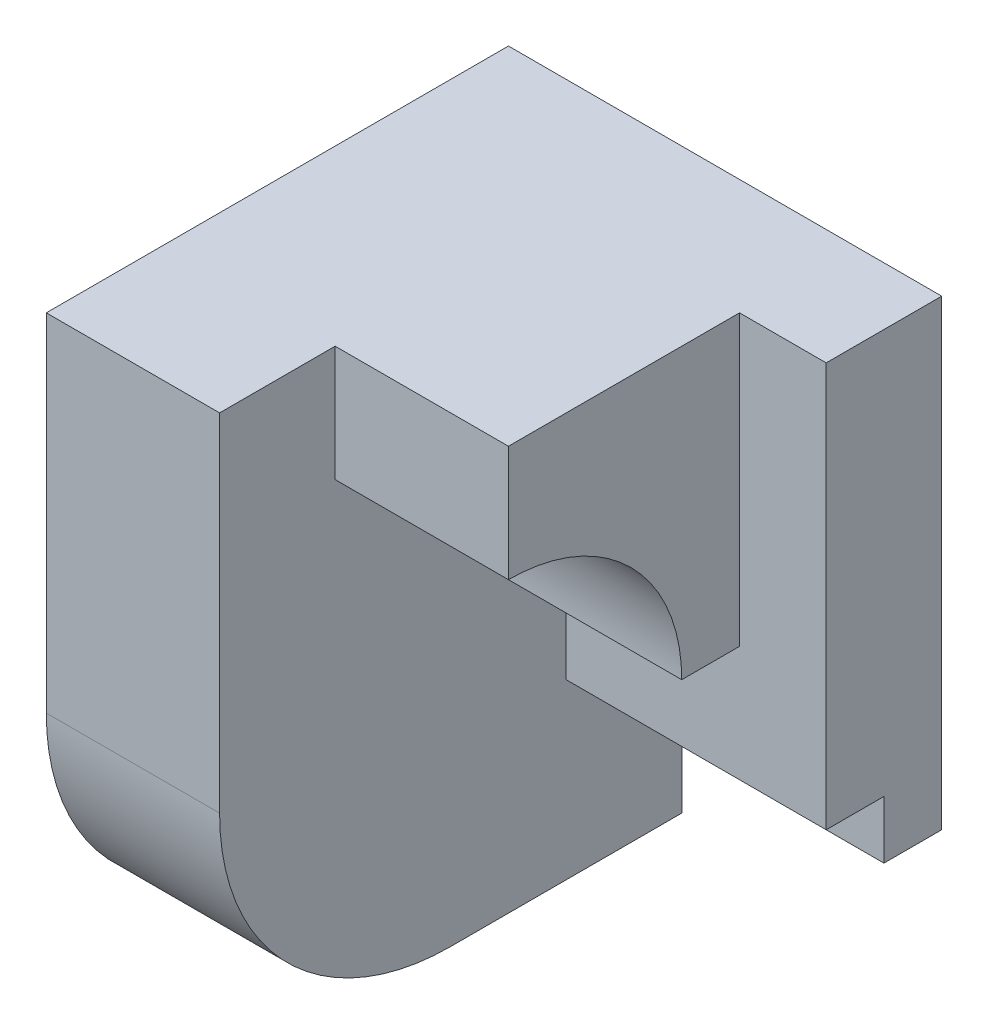
ISO-10303-21;
HEADER;
FILE_DESCRIPTION(('STEP AP214'),'2;1');
FILE_NAME('part.step','',(''),(''),'','','');
FILE_SCHEMA(('AUTOMOTIVE_DESIGN { 1 0 10303 214 1 1 1 1 }'));
ENDSEC;
DATA;
#1=APPLICATION_CONTEXT('core data for automotive mechanical design processes');
#2=APPLICATION_PROTOCOL_DEFINITION('international standard','automotive_design',2000,#1);
#3=PRODUCT_CONTEXT('',#1,'mechanical');
#4=PRODUCT('Part','Part','',(#3));
#5=PRODUCT_RELATED_PRODUCT_CATEGORY('part','',(#4));
#6=PRODUCT_DEFINITION_FORMATION('','',#4);
#7=PRODUCT_DEFINITION_CONTEXT('part definition',#1,'design');
#8=PRODUCT_DEFINITION('design','',#6,#7);
#9=PRODUCT_DEFINITION_SHAPE('','',#8);
#10=(LENGTH_UNIT() NAMED_UNIT(*) SI_UNIT(.MILLI.,.METRE.));
#11=(NAMED_UNIT(*) PLANE_ANGLE_UNIT() SI_UNIT($,.RADIAN.));
#12=(NAMED_UNIT(*) SI_UNIT($,.STERADIAN.) SOLID_ANGLE_UNIT());
#13=UNCERTAINTY_MEASURE_WITH_UNIT(LENGTH_MEASURE(1.E-05),#10,'distance_accuracy_value','');
#14=(GEOMETRIC_REPRESENTATION_CONTEXT(3) GLOBAL_UNCERTAINTY_ASSIGNED_CONTEXT((#13)) GLOBAL_UNIT_ASSIGNED_CONTEXT((#10,
#11,#12)) REPRESENTATION_CONTEXT('',''));
#15=CARTESIAN_POINT('',(0.,0.,0.));
#16=DIRECTION('',(0.,0.,1.));
#17=DIRECTION('',(1.,0.,0.));
#18=AXIS2_PLACEMENT_3D('',#15,#16,#17);
#19=CARTESIAN_POINT('',(3.,-1.,0.));
#20=DIRECTION('',(-1.,0.,0.));
#21=DIRECTION('',(0.,0.,1.));
#22=AXIS2_PLACEMENT_3D('',#19,#20,#21);
#23=PLANE('',#22);
#24=DIRECTION('',(0.,-1.,0.));
#25=VECTOR('',#24,1.);
#26=CARTESIAN_POINT('',(3.,0.,-2.));
#27=LINE('',#26,#25);
#28=CARTESIAN_POINT('',(3.,0.,-2.));
#29=VERTEX_POINT('',#28);
#30=CARTESIAN_POINT('',(3.,-2.,-2.));
#31=VERTEX_POINT('',#30);
#32=EDGE_CURVE('E193',#29,#31,#27,.T.);
#33=ORIENTED_EDGE('',*,*,#32,.F.);
#34=DIRECTION('',(0.,0.,1.));
#35=VECTOR('',#34,1.);
#36=CARTESIAN_POINT('',(3.,0.,0.));
#37=LINE('',#36,#35);
#38=CARTESIAN_POINT('',(3.,0.,-1.));
#39=VERTEX_POINT('',#38);
#40=EDGE_CURVE('E164',#29,#39,#37,.T.);
#41=ORIENTED_EDGE('',*,*,#40,.T.);
#42=CARTESIAN_POINT('',(3.,0.,2.));
#43=DIRECTION('',(1.,0.,0.));
#44=DIRECTION('',(0.,0.,-1.));
#45=AXIS2_PLACEMENT_3D('',#42,#43,#44);
#46=CIRCLE('',#45,3.);
#47=CARTESIAN_POINT('',(3.,3.,2.));
#48=VERTEX_POINT('',#47);
#49=EDGE_CURVE('E141',#39,#48,#46,.T.);
#50=ORIENTED_EDGE('',*,*,#49,.T.);
#51=DIRECTION('',(0.,-1.,0.));
#52=VECTOR('',#51,1.);
#53=CARTESIAN_POINT('',(3.,0.,2.));
#54=LINE('',#53,#52);
#55=CARTESIAN_POINT('',(3.,5.,2.));
#56=VERTEX_POINT('',#55);
#57=EDGE_CURVE('E150',#56,#48,#54,.T.);
#58=ORIENTED_EDGE('',*,*,#57,.F.);
#59=DIRECTION('',(0.,0.,1.));
#60=VECTOR('',#59,1.);
#61=CARTESIAN_POINT('',(3.,5.,-4.));
#62=LINE('',#61,#60);
#63=CARTESIAN_POINT('',(3.,5.,4.));
#64=VERTEX_POINT('',#63);
#65=EDGE_CURVE('E220',#56,#64,#62,.T.);
#66=ORIENTED_EDGE('',*,*,#65,.T.);
#67=DIRECTION('',(0.,-1.,0.));
#68=VECTOR('',#67,1.);
#69=CARTESIAN_POINT('',(3.,-0.999999999999971,4.));
#70=LINE('',#69,#68);
#71=CARTESIAN_POINT('',(3.,-1.,4.));
#72=VERTEX_POINT('',#71);
#73=EDGE_CURVE('E209',#64,#72,#70,.T.);
#74=ORIENTED_EDGE('',*,*,#73,.T.);
#75=CARTESIAN_POINT('',(3.,-1.,0.));
#76=DIRECTION('',(1.,0.,0.));
#77=DIRECTION('',(0.,0.,1.));
#78=AXIS2_PLACEMENT_3D('',#75,#76,#77);
#79=CIRCLE('',#78,4.);
#80=CARTESIAN_POINT('',(3.,-5.,0.));
#81=VERTEX_POINT('',#80);
#82=EDGE_CURVE('E212',#72,#81,#79,.T.);
#83=ORIENTED_EDGE('',*,*,#82,.T.);
#84=DIRECTION('',(0.,0.,-1.));
#85=VECTOR('',#84,1.);
#86=CARTESIAN_POINT('',(3.,-5.,-4.));
#87=LINE('',#86,#85);
#88=CARTESIAN_POINT('',(3.,-5.,-4.));
#89=VERTEX_POINT('',#88);
#90=EDGE_CURVE('E215',#81,#89,#87,.T.);
#91=ORIENTED_EDGE('',*,*,#90,.T.);
#92=DIRECTION('',(0.,1.,0.));
#93=VECTOR('',#92,1.);
#94=CARTESIAN_POINT('',(3.,-5.,-4.));
#95=LINE('',#94,#93);
#96=CARTESIAN_POINT('',(3.,-3.,-4.));
#97=VERTEX_POINT('',#96);
#98=EDGE_CURVE('E217',#89,#97,#95,.T.);
#99=ORIENTED_EDGE('',*,*,#98,.T.);
#100=DIRECTION('',(0.,0.,1.));
#101=VECTOR('',#100,1.);
#102=CARTESIAN_POINT('',(3.,-3.,0.));
#103=LINE('',#102,#101);
#104=CARTESIAN_POINT('',(3.,-3.,-3.));
#105=VERTEX_POINT('',#104);
#106=EDGE_CURVE('E190',#97,#105,#103,.T.);
#107=ORIENTED_EDGE('',*,*,#106,.T.);
#108=DIRECTION('',(0.,1.,0.));
#109=VECTOR('',#108,1.);
#110=CARTESIAN_POINT('',(3.,0.,-3.));
#111=LINE('',#110,#109);
#112=CARTESIAN_POINT('',(3.,-2.,-3.));
#113=VERTEX_POINT('',#112);
#114=EDGE_CURVE('E58',#105,#113,#111,.T.);
#115=ORIENTED_EDGE('',*,*,#114,.T.);
#116=DIRECTION('',(0.,0.,-1.));
#117=VECTOR('',#116,1.);
#118=CARTESIAN_POINT('',(3.,-2.,0.));
#119=LINE('',#118,#117);
#120=EDGE_CURVE('E176',#31,#113,#119,.T.);
#121=ORIENTED_EDGE('',*,*,#120,.F.);
#122=EDGE_LOOP('',(#33,#41,#50,#58,#66,#74,#83,#91,#99,#107,#115,#121));
#123=FACE_BOUND('',#122,.T.);
#124=ADVANCED_FACE('F35',(#123),#23,.F.);
#125=CARTESIAN_POINT('',(3.,-0.999999999999971,4.));
#126=DIRECTION('',(0.,0.,-1.));
#127=DIRECTION('',(-1.,0.,0.));
#128=AXIS2_PLACEMENT_3D('',#125,#126,#127);
#129=PLANE('',#128);
#130=DIRECTION('',(0.,-1.,0.));
#131=VECTOR('',#130,1.);
#132=CARTESIAN_POINT('',(0.,-0.999999999999971,4.));
#133=LINE('',#132,#131);
#134=CARTESIAN_POINT('',(0.,5.,4.));
#135=VERTEX_POINT('',#134);
#136=CARTESIAN_POINT('',(0.,-1.,4.));
#137=VERTEX_POINT('',#136);
#138=EDGE_CURVE('E208',#135,#137,#133,.T.);
#139=ORIENTED_EDGE('',*,*,#138,.T.);
#140=DIRECTION('',(-1.,0.,0.));
#141=VECTOR('',#140,1.);
#142=CARTESIAN_POINT('',(3.,-1.,4.));
#143=LINE('',#142,#141);
#144=EDGE_CURVE('E11',#72,#137,#143,.T.);
#145=ORIENTED_EDGE('',*,*,#144,.F.);
#146=ORIENTED_EDGE('',*,*,#73,.F.);
#147=DIRECTION('',(-1.,0.,0.));
#148=VECTOR('',#147,1.);
#149=CARTESIAN_POINT('',(3.,5.,4.));
#150=LINE('',#149,#148);
#151=EDGE_CURVE('E222',#64,#135,#150,.T.);
#152=ORIENTED_EDGE('',*,*,#151,.T.);
#153=EDGE_LOOP('',(#139,#145,#146,#152));
#154=FACE_BOUND('',#153,.T.);
#155=ADVANCED_FACE('F37',(#154),#129,.F.);
#156=CARTESIAN_POINT('',(3.,-1.,0.));
#157=DIRECTION('',(-1.,0.,0.));
#158=DIRECTION('',(0.,0.,1.));
#159=AXIS2_PLACEMENT_3D('',#156,#157,#158);
#160=CYLINDRICAL_SURFACE('',#159,4.);
#161=CARTESIAN_POINT('',(0.,-1.,0.));
#162=DIRECTION('',(1.,0.,0.));
#163=DIRECTION('',(0.,0.,1.));
#164=AXIS2_PLACEMENT_3D('',#161,#162,#163);
#165=CIRCLE('',#164,4.);
#166=CARTESIAN_POINT('',(0.,-5.,0.));
#167=VERTEX_POINT('',#166);
#168=EDGE_CURVE('E225',#137,#167,#165,.T.);
#169=ORIENTED_EDGE('',*,*,#168,.T.);
#170=DIRECTION('',(-1.,0.,0.));
#171=VECTOR('',#170,1.);
#172=CARTESIAN_POINT('',(3.,-5.,0.));
#173=LINE('',#172,#171);
#174=EDGE_CURVE('E43',#81,#167,#173,.T.);
#175=ORIENTED_EDGE('',*,*,#174,.F.);
#176=ORIENTED_EDGE('',*,*,#82,.F.);
#177=ORIENTED_EDGE('',*,*,#144,.T.);
#178=EDGE_LOOP('',(#169,#175,#176,#177));
#179=FACE_BOUND('',#178,.T.);
#180=ADVANCED_FACE('F276',(#179),#160,.T.);
#181=CARTESIAN_POINT('',(3.,-5.,-4.));
#182=DIRECTION('',(0.,1.,0.));
#183=DIRECTION('',(0.,0.,1.));
#184=AXIS2_PLACEMENT_3D('',#181,#182,#183);
#185=PLANE('',#184);
#186=DIRECTION('',(0.,0.,-1.));
#187=VECTOR('',#186,1.);
#188=CARTESIAN_POINT('',(0.,-5.,-4.));
#189=LINE('',#188,#187);
#190=CARTESIAN_POINT('',(0.,-5.,-4.));
#191=VERTEX_POINT('',#190);
#192=EDGE_CURVE('E227',#167,#191,#189,.T.);
#193=ORIENTED_EDGE('',*,*,#192,.T.);
#194=DIRECTION('',(-1.,0.,0.));
#195=VECTOR('',#194,1.);
#196=CARTESIAN_POINT('',(3.,-5.,-4.));
#197=LINE('',#196,#195);
#198=EDGE_CURVE('E237',#89,#191,#197,.T.);
#199=ORIENTED_EDGE('',*,*,#198,.F.);
#200=ORIENTED_EDGE('',*,*,#90,.F.);
#201=ORIENTED_EDGE('',*,*,#174,.T.);
#202=EDGE_LOOP('',(#193,#199,#200,#201));
#203=FACE_BOUND('',#202,.T.);
#204=ADVANCED_FACE('F244',(#203),#185,.F.);
#205=CARTESIAN_POINT('',(3.,-5.,-4.));
#206=DIRECTION('',(0.,0.,1.));
#207=DIRECTION('',(1.,0.,0.));
#208=AXIS2_PLACEMENT_3D('',#205,#206,#207);
#209=PLANE('',#208);
#210=DIRECTION('',(0.,1.,0.));
#211=VECTOR('',#210,1.);
#212=CARTESIAN_POINT('',(0.,-5.,-4.));
#213=LINE('',#212,#211);
#214=CARTESIAN_POINT('',(0.,5.,-4.));
#215=VERTEX_POINT('',#214);
#216=EDGE_CURVE('E229',#191,#215,#213,.T.);
#217=ORIENTED_EDGE('',*,*,#216,.T.);
#218=DIRECTION('',(-1.,0.,0.));
#219=VECTOR('',#218,1.);
#220=CARTESIAN_POINT('',(3.,5.,-4.));
#221=LINE('',#220,#219);
#222=CARTESIAN_POINT('',(7.5,5.,-4.));
#223=VERTEX_POINT('',#222);
#224=EDGE_CURVE('E234',#223,#215,#221,.T.);
#225=ORIENTED_EDGE('',*,*,#224,.F.);
#226=DIRECTION('',(0.,1.,0.));
#227=VECTOR('',#226,1.);
#228=CARTESIAN_POINT('',(7.5,0.,-4.));
#229=LINE('',#228,#227);
#230=CARTESIAN_POINT('',(7.5,-3.,-4.));
#231=VERTEX_POINT('',#230);
#232=EDGE_CURVE('E179',#231,#223,#229,.T.);
#233=ORIENTED_EDGE('',*,*,#232,.F.);
#234=DIRECTION('',(-1.,0.,0.));
#235=VECTOR('',#234,1.);
#236=CARTESIAN_POINT('',(7.5,-3.,-4.));
#237=LINE('',#236,#235);
#238=EDGE_CURVE('E204',#231,#97,#237,.T.);
#239=ORIENTED_EDGE('',*,*,#238,.T.);
#240=ORIENTED_EDGE('',*,*,#98,.F.);
#241=ORIENTED_EDGE('',*,*,#198,.T.);
#242=EDGE_LOOP('',(#217,#225,#233,#239,#240,#241));
#243=FACE_BOUND('',#242,.T.);
#244=ADVANCED_FACE('F253',(#243),#209,.F.);
#245=CARTESIAN_POINT('',(3.,5.,-4.));
#246=DIRECTION('',(0.,-1.,0.));
#247=DIRECTION('',(0.,0.,-1.));
#248=AXIS2_PLACEMENT_3D('',#245,#246,#247);
#249=PLANE('',#248);
#250=ORIENTED_EDGE('',*,*,#65,.F.);
#251=DIRECTION('',(-1.,0.,0.));
#252=VECTOR('',#251,1.);
#253=CARTESIAN_POINT('',(6.,5.,2.));
#254=LINE('',#253,#252);
#255=CARTESIAN_POINT('',(6.,5.,2.));
#256=VERTEX_POINT('',#255);
#257=EDGE_CURVE('E169',#256,#56,#254,.T.);
#258=ORIENTED_EDGE('',*,*,#257,.F.);
#259=DIRECTION('',(0.,0.,1.));
#260=VECTOR('',#259,1.);
#261=CARTESIAN_POINT('',(6.,5.,0.));
#262=LINE('',#261,#260);
#263=CARTESIAN_POINT('',(6.,5.,-2.));
#264=VERTEX_POINT('',#263);
#265=EDGE_CURVE('E157',#264,#256,#262,.T.);
#266=ORIENTED_EDGE('',*,*,#265,.F.);
#267=DIRECTION('',(-1.,0.,0.));
#268=VECTOR('',#267,1.);
#269=CARTESIAN_POINT('',(7.5,5.,-2.));
#270=LINE('',#269,#268);
#271=CARTESIAN_POINT('',(7.5,5.,-2.));
#272=VERTEX_POINT('',#271);
#273=EDGE_CURVE('E201',#272,#264,#270,.T.);
#274=ORIENTED_EDGE('',*,*,#273,.F.);
#275=DIRECTION('',(0.,0.,1.));
#276=VECTOR('',#275,1.);
#277=CARTESIAN_POINT('',(7.5,5.,0.));
#278=LINE('',#277,#276);
#279=EDGE_CURVE('E182',#223,#272,#278,.T.);
#280=ORIENTED_EDGE('',*,*,#279,.F.);
#281=ORIENTED_EDGE('',*,*,#224,.T.);
#282=DIRECTION('',(0.,0.,1.));
#283=VECTOR('',#282,1.);
#284=CARTESIAN_POINT('',(0.,5.,-4.));
#285=LINE('',#284,#283);
#286=EDGE_CURVE('E213',#215,#135,#285,.T.);
#287=ORIENTED_EDGE('',*,*,#286,.T.);
#288=ORIENTED_EDGE('',*,*,#151,.F.);
#289=EDGE_LOOP('',(#250,#258,#266,#274,#280,#281,#287,#288));
#290=FACE_BOUND('',#289,.T.);
#291=ADVANCED_FACE('F259',(#290),#249,.F.);
#292=CARTESIAN_POINT('',(0.,-1.,0.));
#293=DIRECTION('',(-1.,0.,0.));
#294=DIRECTION('',(0.,0.,1.));
#295=AXIS2_PLACEMENT_3D('',#292,#293,#294);
#296=PLANE('',#295);
#297=ORIENTED_EDGE('',*,*,#138,.F.);
#298=ORIENTED_EDGE('',*,*,#286,.F.);
#299=ORIENTED_EDGE('',*,*,#216,.F.);
#300=ORIENTED_EDGE('',*,*,#192,.F.);
#301=ORIENTED_EDGE('',*,*,#168,.F.);
#302=EDGE_LOOP('',(#297,#298,#299,#300,#301));
#303=FACE_BOUND('',#302,.T.);
#304=ADVANCED_FACE('F250',(#303),#296,.T.);
#305=CARTESIAN_POINT('',(7.5,0.,-3.));
#306=DIRECTION('',(0.,0.,1.));
#307=DIRECTION('',(1.,0.,0.));
#308=AXIS2_PLACEMENT_3D('',#305,#306,#307);
#309=PLANE('',#308);
#310=ORIENTED_EDGE('',*,*,#114,.F.);
#311=DIRECTION('',(-1.,0.,0.));
#312=VECTOR('',#311,1.);
#313=CARTESIAN_POINT('',(7.5,-3.,-3.));
#314=LINE('',#313,#312);
#315=CARTESIAN_POINT('',(7.5,-3.,-3.));
#316=VERTEX_POINT('',#315);
#317=EDGE_CURVE('E206',#316,#105,#314,.T.);
#318=ORIENTED_EDGE('',*,*,#317,.F.);
#319=DIRECTION('',(0.,1.,0.));
#320=VECTOR('',#319,1.);
#321=CARTESIAN_POINT('',(7.5,0.,-3.));
#322=LINE('',#321,#320);
#323=CARTESIAN_POINT('',(7.5,-2.,-3.));
#324=VERTEX_POINT('',#323);
#325=EDGE_CURVE('E172',#316,#324,#322,.T.);
#326=ORIENTED_EDGE('',*,*,#325,.T.);
#327=DIRECTION('',(-1.,0.,0.));
#328=VECTOR('',#327,1.);
#329=CARTESIAN_POINT('',(7.5,-2.,-3.));
#330=LINE('',#329,#328);
#331=EDGE_CURVE('E188',#324,#113,#330,.T.);
#332=ORIENTED_EDGE('',*,*,#331,.T.);
#333=EDGE_LOOP('',(#310,#318,#326,#332));
#334=FACE_BOUND('',#333,.T.);
#335=ADVANCED_FACE('F297',(#334),#309,.T.);
#336=CARTESIAN_POINT('',(7.5,-3.,0.));
#337=DIRECTION('',(0.,-1.,0.));
#338=DIRECTION('',(0.,0.,-1.));
#339=AXIS2_PLACEMENT_3D('',#336,#337,#338);
#340=PLANE('',#339);
#341=ORIENTED_EDGE('',*,*,#106,.F.);
#342=ORIENTED_EDGE('',*,*,#238,.F.);
#343=DIRECTION('',(0.,0.,1.));
#344=VECTOR('',#343,1.);
#345=CARTESIAN_POINT('',(7.5,-3.,0.));
#346=LINE('',#345,#344);
#347=EDGE_CURVE('E175',#231,#316,#346,.T.);
#348=ORIENTED_EDGE('',*,*,#347,.T.);
#349=ORIENTED_EDGE('',*,*,#317,.T.);
#350=EDGE_LOOP('',(#341,#342,#348,#349));
#351=FACE_BOUND('',#350,.T.);
#352=ADVANCED_FACE('F271',(#351),#340,.T.);
#353=CARTESIAN_POINT('',(7.5,0.,-2.));
#354=DIRECTION('',(0.,0.,-1.));
#355=DIRECTION('',(-1.,0.,0.));
#356=AXIS2_PLACEMENT_3D('',#353,#354,#355);
#357=PLANE('',#356);
#358=DIRECTION('',(0.,1.,0.));
#359=VECTOR('',#358,1.);
#360=CARTESIAN_POINT('',(6.,0.,-2.));
#361=LINE('',#360,#359);
#362=CARTESIAN_POINT('',(6.,0.,-2.));
#363=VERTEX_POINT('',#362);
#364=EDGE_CURVE('E155',#363,#264,#361,.T.);
#365=ORIENTED_EDGE('',*,*,#364,.F.);
#366=DIRECTION('',(-1.,0.,0.));
#367=VECTOR('',#366,1.);
#368=CARTESIAN_POINT('',(6.,0.,-2.));
#369=LINE('',#368,#367);
#370=EDGE_CURVE('E144',#363,#29,#369,.T.);
#371=ORIENTED_EDGE('',*,*,#370,.T.);
#372=ORIENTED_EDGE('',*,*,#32,.T.);
#373=DIRECTION('',(-1.,0.,0.));
#374=VECTOR('',#373,1.);
#375=CARTESIAN_POINT('',(7.5,-2.,-2.));
#376=LINE('',#375,#374);
#377=CARTESIAN_POINT('',(7.5,-2.,-2.));
#378=VERTEX_POINT('',#377);
#379=EDGE_CURVE('E198',#378,#31,#376,.T.);
#380=ORIENTED_EDGE('',*,*,#379,.F.);
#381=DIRECTION('',(0.,-1.,0.));
#382=VECTOR('',#381,1.);
#383=CARTESIAN_POINT('',(7.5,0.,-2.));
#384=LINE('',#383,#382);
#385=EDGE_CURVE('E184',#272,#378,#384,.T.);
#386=ORIENTED_EDGE('',*,*,#385,.F.);
#387=ORIENTED_EDGE('',*,*,#273,.T.);
#388=EDGE_LOOP('',(#365,#371,#372,#380,#386,#387));
#389=FACE_BOUND('',#388,.T.);
#390=ADVANCED_FACE('F339',(#389),#357,.F.);
#391=CARTESIAN_POINT('',(7.5,-2.,0.));
#392=DIRECTION('',(0.,1.,0.));
#393=DIRECTION('',(0.,0.,1.));
#394=AXIS2_PLACEMENT_3D('',#391,#392,#393);
#395=PLANE('',#394);
#396=ORIENTED_EDGE('',*,*,#120,.T.);
#397=ORIENTED_EDGE('',*,*,#331,.F.);
#398=DIRECTION('',(0.,0.,-1.));
#399=VECTOR('',#398,1.);
#400=CARTESIAN_POINT('',(7.5,-2.,0.));
#401=LINE('',#400,#399);
#402=EDGE_CURVE('E186',#378,#324,#401,.T.);
#403=ORIENTED_EDGE('',*,*,#402,.F.);
#404=ORIENTED_EDGE('',*,*,#379,.T.);
#405=EDGE_LOOP('',(#396,#397,#403,#404));
#406=FACE_BOUND('',#405,.T.);
#407=ADVANCED_FACE('F345',(#406),#395,.F.);
#408=CARTESIAN_POINT('',(7.5,0.,0.));
#409=DIRECTION('',(1.,0.,0.));
#410=DIRECTION('',(0.,0.,-1.));
#411=AXIS2_PLACEMENT_3D('',#408,#409,#410);
#412=PLANE('',#411);
#413=ORIENTED_EDGE('',*,*,#325,.F.);
#414=ORIENTED_EDGE('',*,*,#347,.F.);
#415=ORIENTED_EDGE('',*,*,#232,.T.);
#416=ORIENTED_EDGE('',*,*,#279,.T.);
#417=ORIENTED_EDGE('',*,*,#385,.T.);
#418=ORIENTED_EDGE('',*,*,#402,.T.);
#419=EDGE_LOOP('',(#413,#414,#415,#416,#417,#418));
#420=FACE_BOUND('',#419,.T.);
#421=ADVANCED_FACE('F266',(#420),#412,.T.);
#422=CARTESIAN_POINT('',(6.,0.,2.));
#423=DIRECTION('',(-1.,0.,0.));
#424=DIRECTION('',(0.,0.,1.));
#425=AXIS2_PLACEMENT_3D('',#422,#423,#424);
#426=CYLINDRICAL_SURFACE('',#425,3.);
#427=ORIENTED_EDGE('',*,*,#49,.F.);
#428=DIRECTION('',(-1.,0.,0.));
#429=VECTOR('',#428,1.);
#430=CARTESIAN_POINT('',(6.,0.,-1.));
#431=LINE('',#430,#429);
#432=CARTESIAN_POINT('',(6.,0.,-1.));
#433=VERTEX_POINT('',#432);
#434=EDGE_CURVE('E137',#433,#39,#431,.T.);
#435=ORIENTED_EDGE('',*,*,#434,.F.);
#436=CARTESIAN_POINT('',(6.,0.,2.));
#437=DIRECTION('',(1.,0.,0.));
#438=DIRECTION('',(0.,0.,-1.));
#439=AXIS2_PLACEMENT_3D('',#436,#437,#438);
#440=CIRCLE('',#439,3.);
#441=CARTESIAN_POINT('',(6.,3.,2.));
#442=VERTEX_POINT('',#441);
#443=EDGE_CURVE('E139',#433,#442,#440,.T.);
#444=ORIENTED_EDGE('',*,*,#443,.T.);
#445=DIRECTION('',(-1.,0.,0.));
#446=VECTOR('',#445,1.);
#447=CARTESIAN_POINT('',(6.,3.,2.));
#448=LINE('',#447,#446);
#449=EDGE_CURVE('E162',#442,#48,#448,.T.);
#450=ORIENTED_EDGE('',*,*,#449,.T.);
#451=EDGE_LOOP('',(#427,#435,#444,#450));
#452=FACE_BOUND('',#451,.T.);
#453=ADVANCED_FACE('F138',(#452),#426,.F.);
#454=CARTESIAN_POINT('',(6.,0.,0.));
#455=DIRECTION('',(0.,-1.,0.));
#456=DIRECTION('',(0.,0.,-1.));
#457=AXIS2_PLACEMENT_3D('',#454,#455,#456);
#458=PLANE('',#457);
#459=ORIENTED_EDGE('',*,*,#40,.F.);
#460=ORIENTED_EDGE('',*,*,#370,.F.);
#461=DIRECTION('',(0.,0.,1.));
#462=VECTOR('',#461,1.);
#463=CARTESIAN_POINT('',(6.,0.,0.));
#464=LINE('',#463,#462);
#465=EDGE_CURVE('E50',#363,#433,#464,.T.);
#466=ORIENTED_EDGE('',*,*,#465,.T.);
#467=ORIENTED_EDGE('',*,*,#434,.T.);
#468=EDGE_LOOP('',(#459,#460,#466,#467));
#469=FACE_BOUND('',#468,.T.);
#470=ADVANCED_FACE('F152',(#469),#458,.T.);
#471=CARTESIAN_POINT('',(6.,0.,2.));
#472=DIRECTION('',(0.,0.,-1.));
#473=DIRECTION('',(0.,1.,0.));
#474=AXIS2_PLACEMENT_3D('',#471,#472,#473);
#475=PLANE('',#474);
#476=ORIENTED_EDGE('',*,*,#57,.T.);
#477=ORIENTED_EDGE('',*,*,#449,.F.);
#478=DIRECTION('',(0.,-1.,0.));
#479=VECTOR('',#478,1.);
#480=CARTESIAN_POINT('',(6.,0.,2.));
#481=LINE('',#480,#479);
#482=EDGE_CURVE('E148',#256,#442,#481,.T.);
#483=ORIENTED_EDGE('',*,*,#482,.F.);
#484=ORIENTED_EDGE('',*,*,#257,.T.);
#485=EDGE_LOOP('',(#476,#477,#483,#484));
#486=FACE_BOUND('',#485,.T.);
#487=ADVANCED_FACE('F281',(#486),#475,.F.);
#488=CARTESIAN_POINT('',(6.,0.,0.));
#489=DIRECTION('',(1.,0.,0.));
#490=DIRECTION('',(0.,0.,-1.));
#491=AXIS2_PLACEMENT_3D('',#488,#489,#490);
#492=PLANE('',#491);
#493=ORIENTED_EDGE('',*,*,#443,.F.);
#494=ORIENTED_EDGE('',*,*,#465,.F.);
#495=ORIENTED_EDGE('',*,*,#364,.T.);
#496=ORIENTED_EDGE('',*,*,#265,.T.);
#497=ORIENTED_EDGE('',*,*,#482,.T.);
#498=EDGE_LOOP('',(#493,#494,#495,#496,#497));
#499=FACE_BOUND('',#498,.T.);
#500=ADVANCED_FACE('F146',(#499),#492,.T.);
#501=CLOSED_SHELL('',(#124,#155,#180,#204,#244,#291,#304,#335,#352,#390,#407,#421,#453,#470,
#487,#500));
#502=MANIFOLD_SOLID_BREP('B2',#501);
#503=ADVANCED_BREP_SHAPE_REPRESENTATION('',(#18,#502),#14);
#504=SHAPE_DEFINITION_REPRESENTATION(#9,#503);
ENDSEC;
END-ISO-10303-21;
